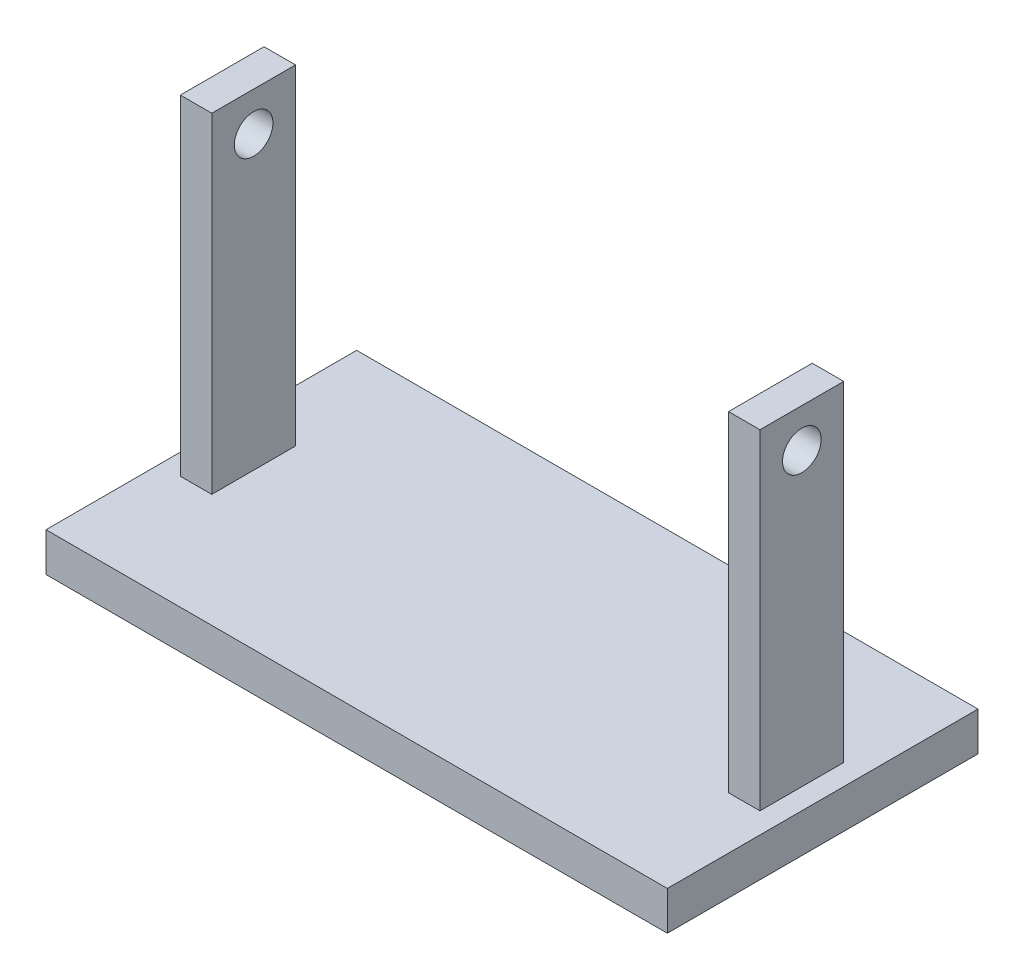
ISO-10303-21;
HEADER;
FILE_DESCRIPTION(('STEP AP214'),'2;1');
FILE_NAME('part.step','',(''),(''),'','','');
FILE_SCHEMA(('AUTOMOTIVE_DESIGN { 1 0 10303 214 1 1 1 1 }'));
ENDSEC;
DATA;
#1=APPLICATION_CONTEXT('core data for automotive mechanical design processes');
#2=APPLICATION_PROTOCOL_DEFINITION('international standard','automotive_design',2000,#1);
#3=PRODUCT_CONTEXT('',#1,'mechanical');
#4=PRODUCT('Part','Part','',(#3));
#5=PRODUCT_RELATED_PRODUCT_CATEGORY('part','',(#4));
#6=PRODUCT_DEFINITION_FORMATION('','',#4);
#7=PRODUCT_DEFINITION_CONTEXT('part definition',#1,'design');
#8=PRODUCT_DEFINITION('design','',#6,#7);
#9=PRODUCT_DEFINITION_SHAPE('','',#8);
#10=(LENGTH_UNIT() NAMED_UNIT(*) SI_UNIT(.MILLI.,.METRE.));
#11=(NAMED_UNIT(*) PLANE_ANGLE_UNIT() SI_UNIT($,.RADIAN.));
#12=(NAMED_UNIT(*) SI_UNIT($,.STERADIAN.) SOLID_ANGLE_UNIT());
#13=UNCERTAINTY_MEASURE_WITH_UNIT(LENGTH_MEASURE(1.E-05),#10,'distance_accuracy_value','');
#14=(GEOMETRIC_REPRESENTATION_CONTEXT(3) GLOBAL_UNCERTAINTY_ASSIGNED_CONTEXT((#13)) GLOBAL_UNIT_ASSIGNED_CONTEXT((#10,
#11,#12)) REPRESENTATION_CONTEXT('',''));
#15=CARTESIAN_POINT('',(0.,0.,0.));
#16=DIRECTION('',(0.,0.,1.));
#17=DIRECTION('',(1.,0.,0.));
#18=AXIS2_PLACEMENT_3D('',#15,#16,#17);
#19=CARTESIAN_POINT('',(74.6314159810439,95.,-10.7820456424634));
#20=DIRECTION('',(1.,0.,0.));
#21=DIRECTION('',(0.,0.,-1.));
#22=AXIS2_PLACEMENT_3D('',#19,#20,#21);
#23=PLANE('',#22);
#24=CARTESIAN_POINT('',(74.6314159810439,85.,0.));
#25=DIRECTION('',(1.,0.,0.));
#26=DIRECTION('',(0.,0.,-1.));
#27=AXIS2_PLACEMENT_3D('',#24,#25,#26);
#28=CIRCLE('',#27,4.97317490050383);
#29=CARTESIAN_POINT('',(74.6314159810439,85.,-4.97317490050384));
#30=VERTEX_POINT('',#29);
#31=EDGE_CURVE('E293',#30,#30,#28,.T.);
#32=ORIENTED_EDGE('',*,*,#31,.F.);
#33=EDGE_LOOP('',(#32));
#34=FACE_BOUND('',#33,.T.);
#35=DIRECTION('',(0.,-1.,0.));
#36=VECTOR('',#35,1.);
#37=CARTESIAN_POINT('',(74.6314159810439,95.,10.7820456424634));
#38=LINE('',#37,#36);
#39=CARTESIAN_POINT('',(74.6314159810439,95.,10.7820456424634));
#40=VERTEX_POINT('',#39);
#41=CARTESIAN_POINT('',(74.6314159810439,9.99999999999999,10.7820456424634));
#42=VERTEX_POINT('',#41);
#43=EDGE_CURVE('E208',#40,#42,#38,.T.);
#44=ORIENTED_EDGE('',*,*,#43,.T.);
#45=DIRECTION('',(0.,0.,-1.));
#46=VECTOR('',#45,1.);
#47=CARTESIAN_POINT('',(74.6314159810439,10.,-10.7820456424634));
#48=LINE('',#47,#46);
#49=CARTESIAN_POINT('',(74.6314159810439,10.,-10.7820456424634));
#50=VERTEX_POINT('',#49);
#51=EDGE_CURVE('E49',#42,#50,#48,.T.);
#52=ORIENTED_EDGE('',*,*,#51,.T.);
#53=DIRECTION('',(0.,-1.,0.));
#54=VECTOR('',#53,1.);
#55=CARTESIAN_POINT('',(74.6314159810439,95.,-10.7820456424634));
#56=LINE('',#55,#54);
#57=CARTESIAN_POINT('',(74.6314159810439,95.,-10.7820456424634));
#58=VERTEX_POINT('',#57);
#59=EDGE_CURVE('E11',#58,#50,#56,.T.);
#60=ORIENTED_EDGE('',*,*,#59,.F.);
#61=DIRECTION('',(0.,0.,1.));
#62=VECTOR('',#61,1.);
#63=CARTESIAN_POINT('',(74.6314159810439,95.,-10.7820456424634));
#64=LINE('',#63,#62);
#65=EDGE_CURVE('E200',#58,#40,#64,.T.);
#66=ORIENTED_EDGE('',*,*,#65,.T.);
#67=EDGE_LOOP('',(#44,#52,#60,#66));
#68=FACE_BOUND('',#67,.T.);
#69=ADVANCED_FACE('F33',(#34,#68),#23,.T.);
#70=CARTESIAN_POINT('',(74.6314159810439,95.,-10.7820456424634));
#71=DIRECTION('',(0.,0.,1.));
#72=DIRECTION('',(1.,0.,0.));
#73=AXIS2_PLACEMENT_3D('',#70,#71,#72);
#74=PLANE('',#73);
#75=DIRECTION('',(-1.,0.,0.));
#76=VECTOR('',#75,1.);
#77=CARTESIAN_POINT('',(74.6314159810439,10.,-10.7820456424634));
#78=LINE('',#77,#76);
#79=CARTESIAN_POINT('',(66.5327026150507,10.,-10.7820456424634));
#80=VERTEX_POINT('',#79);
#81=EDGE_CURVE('E162',#50,#80,#78,.T.);
#82=ORIENTED_EDGE('',*,*,#81,.T.);
#83=DIRECTION('',(0.,-1.,0.));
#84=VECTOR('',#83,1.);
#85=CARTESIAN_POINT('',(66.5327026150507,95.,-10.7820456424634));
#86=LINE('',#85,#84);
#87=CARTESIAN_POINT('',(66.5327026150507,95.,-10.7820456424634));
#88=VERTEX_POINT('',#87);
#89=EDGE_CURVE('E41',#88,#80,#86,.T.);
#90=ORIENTED_EDGE('',*,*,#89,.F.);
#91=DIRECTION('',(-1.,0.,0.));
#92=VECTOR('',#91,1.);
#93=CARTESIAN_POINT('',(74.6314159810439,95.,-10.7820456424634));
#94=LINE('',#93,#92);
#95=EDGE_CURVE('E207',#58,#88,#94,.T.);
#96=ORIENTED_EDGE('',*,*,#95,.F.);
#97=ORIENTED_EDGE('',*,*,#59,.T.);
#98=EDGE_LOOP('',(#82,#90,#96,#97));
#99=FACE_BOUND('',#98,.T.);
#100=ADVANCED_FACE('F229',(#99),#74,.F.);
#101=CARTESIAN_POINT('',(66.5327026150507,95.,-10.7820456424634));
#102=DIRECTION('',(1.,0.,0.));
#103=DIRECTION('',(0.,0.,-1.));
#104=AXIS2_PLACEMENT_3D('',#101,#102,#103);
#105=PLANE('',#104);
#106=CARTESIAN_POINT('',(66.5327026150507,85.,0.));
#107=DIRECTION('',(1.,0.,0.));
#108=DIRECTION('',(0.,0.,-1.));
#109=AXIS2_PLACEMENT_3D('',#106,#107,#108);
#110=CIRCLE('',#109,4.97317490050383);
#111=CARTESIAN_POINT('',(66.5327026150507,85.,-4.97317490050384));
#112=VERTEX_POINT('',#111);
#113=EDGE_CURVE('E296',#112,#112,#110,.T.);
#114=ORIENTED_EDGE('',*,*,#113,.T.);
#115=EDGE_LOOP('',(#114));
#116=FACE_BOUND('',#115,.T.);
#117=DIRECTION('',(0.,0.,1.));
#118=VECTOR('',#117,1.);
#119=CARTESIAN_POINT('',(66.5327026150507,10.,-10.7820456424634));
#120=LINE('',#119,#118);
#121=CARTESIAN_POINT('',(66.5327026150507,10.,10.7820456424634));
#122=VERTEX_POINT('',#121);
#123=EDGE_CURVE('E165',#80,#122,#120,.T.);
#124=ORIENTED_EDGE('',*,*,#123,.T.);
#125=DIRECTION('',(0.,-1.,0.));
#126=VECTOR('',#125,1.);
#127=CARTESIAN_POINT('',(66.5327026150507,95.,10.7820456424634));
#128=LINE('',#127,#126);
#129=CARTESIAN_POINT('',(66.5327026150507,95.,10.7820456424634));
#130=VERTEX_POINT('',#129);
#131=EDGE_CURVE('E212',#130,#122,#128,.T.);
#132=ORIENTED_EDGE('',*,*,#131,.F.);
#133=DIRECTION('',(0.,0.,1.));
#134=VECTOR('',#133,1.);
#135=CARTESIAN_POINT('',(66.5327026150507,95.,-10.7820456424634));
#136=LINE('',#135,#134);
#137=EDGE_CURVE('E205',#88,#130,#136,.T.);
#138=ORIENTED_EDGE('',*,*,#137,.F.);
#139=ORIENTED_EDGE('',*,*,#89,.T.);
#140=EDGE_LOOP('',(#124,#132,#138,#139));
#141=FACE_BOUND('',#140,.T.);
#142=ADVANCED_FACE('F225',(#116,#141),#105,.F.);
#143=CARTESIAN_POINT('',(74.6314159810439,95.,10.7820456424634));
#144=DIRECTION('',(0.,0.,1.));
#145=DIRECTION('',(1.,0.,0.));
#146=AXIS2_PLACEMENT_3D('',#143,#144,#145);
#147=PLANE('',#146);
#148=ORIENTED_EDGE('',*,*,#131,.T.);
#149=DIRECTION('',(1.,0.,0.));
#150=VECTOR('',#149,1.);
#151=CARTESIAN_POINT('',(74.6314159810439,10.,10.7820456424634));
#152=LINE('',#151,#150);
#153=EDGE_CURVE('E168',#122,#42,#152,.T.);
#154=ORIENTED_EDGE('',*,*,#153,.T.);
#155=ORIENTED_EDGE('',*,*,#43,.F.);
#156=DIRECTION('',(-1.,0.,0.));
#157=VECTOR('',#156,1.);
#158=CARTESIAN_POINT('',(74.6314159810439,95.,10.7820456424634));
#159=LINE('',#158,#157);
#160=EDGE_CURVE('E202',#40,#130,#159,.T.);
#161=ORIENTED_EDGE('',*,*,#160,.T.);
#162=EDGE_LOOP('',(#148,#154,#155,#161));
#163=FACE_BOUND('',#162,.T.);
#164=ADVANCED_FACE('F218',(#163),#147,.T.);
#165=CARTESIAN_POINT('',(0.,95.,0.));
#166=DIRECTION('',(0.,-1.,0.));
#167=DIRECTION('',(0.,0.,-1.));
#168=AXIS2_PLACEMENT_3D('',#165,#166,#167);
#169=PLANE('',#168);
#170=ORIENTED_EDGE('',*,*,#65,.F.);
#171=ORIENTED_EDGE('',*,*,#95,.T.);
#172=ORIENTED_EDGE('',*,*,#137,.T.);
#173=ORIENTED_EDGE('',*,*,#160,.F.);
#174=EDGE_LOOP('',(#170,#171,#172,#173));
#175=FACE_BOUND('',#174,.T.);
#176=ADVANCED_FACE('F220',(#175),#169,.F.);
#177=CARTESIAN_POINT('',(0.,10.,0.));
#178=DIRECTION('',(0.,-1.,0.));
#179=DIRECTION('',(0.,0.,-1.));
#180=AXIS2_PLACEMENT_3D('',#177,#178,#179);
#181=PLANE('',#180);
#182=ORIENTED_EDGE('',*,*,#51,.F.);
#183=ORIENTED_EDGE('',*,*,#153,.F.);
#184=ORIENTED_EDGE('',*,*,#123,.F.);
#185=ORIENTED_EDGE('',*,*,#81,.F.);
#186=EDGE_LOOP('',(#182,#183,#184,#185));
#187=FACE_BOUND('',#186,.T.);
#188=DIRECTION('',(-1.,0.,0.));
#189=VECTOR('',#188,1.);
#190=CARTESIAN_POINT('',(-80.,10.,-40.));
#191=LINE('',#190,#189);
#192=CARTESIAN_POINT('',(80.,10.,-40.));
#193=VERTEX_POINT('',#192);
#194=CARTESIAN_POINT('',(-80.,10.,-40.));
#195=VERTEX_POINT('',#194);
#196=EDGE_CURVE('E171',#193,#195,#191,.T.);
#197=ORIENTED_EDGE('',*,*,#196,.T.);
#198=DIRECTION('',(0.,0.,1.));
#199=VECTOR('',#198,1.);
#200=CARTESIAN_POINT('',(-80.,10.,-40.));
#201=LINE('',#200,#199);
#202=CARTESIAN_POINT('',(-80.,10.,40.));
#203=VERTEX_POINT('',#202);
#204=EDGE_CURVE('E174',#195,#203,#201,.T.);
#205=ORIENTED_EDGE('',*,*,#204,.T.);
#206=DIRECTION('',(1.,0.,0.));
#207=VECTOR('',#206,1.);
#208=CARTESIAN_POINT('',(-80.,10.,40.));
#209=LINE('',#208,#207);
#210=CARTESIAN_POINT('',(80.,10.,40.));
#211=VERTEX_POINT('',#210);
#212=EDGE_CURVE('E177',#203,#211,#209,.T.);
#213=ORIENTED_EDGE('',*,*,#212,.T.);
#214=DIRECTION('',(0.,0.,-1.));
#215=VECTOR('',#214,1.);
#216=CARTESIAN_POINT('',(80.,10.,-40.));
#217=LINE('',#216,#215);
#218=EDGE_CURVE('E179',#211,#193,#217,.T.);
#219=ORIENTED_EDGE('',*,*,#218,.T.);
#220=EDGE_LOOP('',(#197,#205,#213,#219));
#221=FACE_BOUND('',#220,.T.);
#222=DIRECTION('',(-1.,0.,0.));
#223=VECTOR('',#222,1.);
#224=CARTESIAN_POINT('',(-74.6314159810439,10.,-10.7820456424634));
#225=LINE('',#224,#223);
#226=CARTESIAN_POINT('',(-66.5327026150507,10.,-10.7820456424634));
#227=VERTEX_POINT('',#226);
#228=CARTESIAN_POINT('',(-74.6314159810439,9.99999999999999,-10.7820456424634));
#229=VERTEX_POINT('',#228);
#230=EDGE_CURVE('E129',#227,#229,#225,.T.);
#231=ORIENTED_EDGE('',*,*,#230,.F.);
#232=DIRECTION('',(0.,0.,-1.));
#233=VECTOR('',#232,1.);
#234=CARTESIAN_POINT('',(-66.5327026150507,10.,-10.7820456424634));
#235=LINE('',#234,#233);
#236=CARTESIAN_POINT('',(-66.5327026150507,10.,10.7820456424634));
#237=VERTEX_POINT('',#236);
#238=EDGE_CURVE('E158',#237,#227,#235,.T.);
#239=ORIENTED_EDGE('',*,*,#238,.F.);
#240=DIRECTION('',(1.,0.,0.));
#241=VECTOR('',#240,1.);
#242=CARTESIAN_POINT('',(-74.6314159810439,10.,10.7820456424634));
#243=LINE('',#242,#241);
#244=CARTESIAN_POINT('',(-74.6314159810439,10.,10.7820456424634));
#245=VERTEX_POINT('',#244);
#246=EDGE_CURVE('E155',#245,#237,#243,.T.);
#247=ORIENTED_EDGE('',*,*,#246,.F.);
#248=DIRECTION('',(0.,0.,1.));
#249=VECTOR('',#248,1.);
#250=CARTESIAN_POINT('',(-74.6314159810439,10.,-10.7820456424634));
#251=LINE('',#250,#249);
#252=EDGE_CURVE('E153',#229,#245,#251,.T.);
#253=ORIENTED_EDGE('',*,*,#252,.F.);
#254=EDGE_LOOP('',(#231,#239,#247,#253));
#255=FACE_BOUND('',#254,.T.);
#256=ADVANCED_FACE('F226',(#187,#221,#255),#181,.F.);
#257=CARTESIAN_POINT('',(-80.,10.,-40.));
#258=DIRECTION('',(0.,0.,1.));
#259=DIRECTION('',(1.,0.,0.));
#260=AXIS2_PLACEMENT_3D('',#257,#258,#259);
#261=PLANE('',#260);
#262=DIRECTION('',(-1.,0.,0.));
#263=VECTOR('',#262,1.);
#264=CARTESIAN_POINT('',(-80.,0.,-40.));
#265=LINE('',#264,#263);
#266=CARTESIAN_POINT('',(80.,0.,-40.));
#267=VERTEX_POINT('',#266);
#268=CARTESIAN_POINT('',(-80.,0.,-40.));
#269=VERTEX_POINT('',#268);
#270=EDGE_CURVE('E170',#267,#269,#265,.T.);
#271=ORIENTED_EDGE('',*,*,#270,.T.);
#272=DIRECTION('',(0.,-1.,0.));
#273=VECTOR('',#272,1.);
#274=CARTESIAN_POINT('',(-80.,10.,-40.));
#275=LINE('',#274,#273);
#276=EDGE_CURVE('E197',#195,#269,#275,.T.);
#277=ORIENTED_EDGE('',*,*,#276,.F.);
#278=ORIENTED_EDGE('',*,*,#196,.F.);
#279=DIRECTION('',(0.,-1.,0.));
#280=VECTOR('',#279,1.);
#281=CARTESIAN_POINT('',(80.,10.,-40.));
#282=LINE('',#281,#280);
#283=EDGE_CURVE('E181',#193,#267,#282,.T.);
#284=ORIENTED_EDGE('',*,*,#283,.T.);
#285=EDGE_LOOP('',(#271,#277,#278,#284));
#286=FACE_BOUND('',#285,.T.);
#287=ADVANCED_FACE('F249',(#286),#261,.F.);
#288=CARTESIAN_POINT('',(-80.,10.,-40.));
#289=DIRECTION('',(1.,0.,0.));
#290=DIRECTION('',(0.,0.,-1.));
#291=AXIS2_PLACEMENT_3D('',#288,#289,#290);
#292=PLANE('',#291);
#293=DIRECTION('',(0.,0.,1.));
#294=VECTOR('',#293,1.);
#295=CARTESIAN_POINT('',(-80.,0.,-40.));
#296=LINE('',#295,#294);
#297=CARTESIAN_POINT('',(-80.,0.,40.));
#298=VERTEX_POINT('',#297);
#299=EDGE_CURVE('E184',#269,#298,#296,.T.);
#300=ORIENTED_EDGE('',*,*,#299,.T.);
#301=DIRECTION('',(0.,-1.,0.));
#302=VECTOR('',#301,1.);
#303=CARTESIAN_POINT('',(-80.,10.,40.));
#304=LINE('',#303,#302);
#305=EDGE_CURVE('E194',#203,#298,#304,.T.);
#306=ORIENTED_EDGE('',*,*,#305,.F.);
#307=ORIENTED_EDGE('',*,*,#204,.F.);
#308=ORIENTED_EDGE('',*,*,#276,.T.);
#309=EDGE_LOOP('',(#300,#306,#307,#308));
#310=FACE_BOUND('',#309,.T.);
#311=ADVANCED_FACE('F254',(#310),#292,.F.);
#312=CARTESIAN_POINT('',(-80.,10.,40.));
#313=DIRECTION('',(0.,0.,-1.));
#314=DIRECTION('',(-1.,0.,0.));
#315=AXIS2_PLACEMENT_3D('',#312,#313,#314);
#316=PLANE('',#315);
#317=DIRECTION('',(1.,0.,0.));
#318=VECTOR('',#317,1.);
#319=CARTESIAN_POINT('',(-80.,0.,40.));
#320=LINE('',#319,#318);
#321=CARTESIAN_POINT('',(80.,0.,40.));
#322=VERTEX_POINT('',#321);
#323=EDGE_CURVE('E186',#298,#322,#320,.T.);
#324=ORIENTED_EDGE('',*,*,#323,.T.);
#325=DIRECTION('',(0.,-1.,0.));
#326=VECTOR('',#325,1.);
#327=CARTESIAN_POINT('',(80.,10.,40.));
#328=LINE('',#327,#326);
#329=EDGE_CURVE('E191',#211,#322,#328,.T.);
#330=ORIENTED_EDGE('',*,*,#329,.F.);
#331=ORIENTED_EDGE('',*,*,#212,.F.);
#332=ORIENTED_EDGE('',*,*,#305,.T.);
#333=EDGE_LOOP('',(#324,#330,#331,#332));
#334=FACE_BOUND('',#333,.T.);
#335=ADVANCED_FACE('F258',(#334),#316,.F.);
#336=CARTESIAN_POINT('',(80.,10.,-40.));
#337=DIRECTION('',(-1.,0.,0.));
#338=DIRECTION('',(0.,0.,1.));
#339=AXIS2_PLACEMENT_3D('',#336,#337,#338);
#340=PLANE('',#339);
#341=DIRECTION('',(0.,0.,-1.));
#342=VECTOR('',#341,1.);
#343=CARTESIAN_POINT('',(80.,0.,-40.));
#344=LINE('',#343,#342);
#345=EDGE_CURVE('E175',#322,#267,#344,.T.);
#346=ORIENTED_EDGE('',*,*,#345,.T.);
#347=ORIENTED_EDGE('',*,*,#283,.F.);
#348=ORIENTED_EDGE('',*,*,#218,.F.);
#349=ORIENTED_EDGE('',*,*,#329,.T.);
#350=EDGE_LOOP('',(#346,#347,#348,#349));
#351=FACE_BOUND('',#350,.T.);
#352=ADVANCED_FACE('F262',(#351),#340,.F.);
#353=CARTESIAN_POINT('',(0.,0.,0.));
#354=DIRECTION('',(0.,-1.,0.));
#355=DIRECTION('',(0.,0.,-1.));
#356=AXIS2_PLACEMENT_3D('',#353,#354,#355);
#357=PLANE('',#356);
#358=ORIENTED_EDGE('',*,*,#270,.F.);
#359=ORIENTED_EDGE('',*,*,#345,.F.);
#360=ORIENTED_EDGE('',*,*,#323,.F.);
#361=ORIENTED_EDGE('',*,*,#299,.F.);
#362=EDGE_LOOP('',(#358,#359,#360,#361));
#363=FACE_BOUND('',#362,.T.);
#364=ADVANCED_FACE('F240',(#363),#357,.T.);
#365=CARTESIAN_POINT('',(-74.6314159810439,95.,-10.7820456424634));
#366=DIRECTION('',(1.,0.,0.));
#367=DIRECTION('',(0.,0.,-1.));
#368=AXIS2_PLACEMENT_3D('',#365,#366,#367);
#369=PLANE('',#368);
#370=CARTESIAN_POINT('',(-74.6314159810439,85.,0.));
#371=DIRECTION('',(1.,0.,0.));
#372=DIRECTION('',(0.,0.,-1.));
#373=AXIS2_PLACEMENT_3D('',#370,#371,#372);
#374=CIRCLE('',#373,4.97317490050383);
#375=CARTESIAN_POINT('',(-74.6314159810439,85.,-4.97317490050384));
#376=VERTEX_POINT('',#375);
#377=EDGE_CURVE('E297',#376,#376,#374,.T.);
#378=ORIENTED_EDGE('',*,*,#377,.T.);
#379=EDGE_LOOP('',(#378));
#380=FACE_BOUND('',#379,.T.);
#381=DIRECTION('',(0.,-1.,0.));
#382=VECTOR('',#381,1.);
#383=CARTESIAN_POINT('',(-74.6314159810439,95.,-10.7820456424634));
#384=LINE('',#383,#382);
#385=CARTESIAN_POINT('',(-74.6314159810439,95.,-10.7820456424634));
#386=VERTEX_POINT('',#385);
#387=EDGE_CURVE('E123',#386,#229,#384,.T.);
#388=ORIENTED_EDGE('',*,*,#387,.T.);
#389=ORIENTED_EDGE('',*,*,#252,.T.);
#390=DIRECTION('',(0.,-1.,0.));
#391=VECTOR('',#390,1.);
#392=CARTESIAN_POINT('',(-74.6314159810439,95.,10.7820456424634));
#393=LINE('',#392,#391);
#394=CARTESIAN_POINT('',(-74.6314159810439,95.,10.7820456424634));
#395=VERTEX_POINT('',#394);
#396=EDGE_CURVE('E139',#395,#245,#393,.T.);
#397=ORIENTED_EDGE('',*,*,#396,.F.);
#398=DIRECTION('',(0.,0.,1.));
#399=VECTOR('',#398,1.);
#400=CARTESIAN_POINT('',(-74.6314159810439,95.,-10.7820456424634));
#401=LINE('',#400,#399);
#402=EDGE_CURVE('E136',#386,#395,#401,.T.);
#403=ORIENTED_EDGE('',*,*,#402,.F.);
#404=EDGE_LOOP('',(#388,#389,#397,#403));
#405=FACE_BOUND('',#404,.T.);
#406=ADVANCED_FACE('F137',(#380,#405),#369,.F.);
#407=CARTESIAN_POINT('',(-74.6314159810439,95.,10.7820456424634));
#408=DIRECTION('',(0.,0.,-1.));
#409=DIRECTION('',(-1.,0.,0.));
#410=AXIS2_PLACEMENT_3D('',#407,#408,#409);
#411=PLANE('',#410);
#412=ORIENTED_EDGE('',*,*,#396,.T.);
#413=ORIENTED_EDGE('',*,*,#246,.T.);
#414=DIRECTION('',(0.,-1.,0.));
#415=VECTOR('',#414,1.);
#416=CARTESIAN_POINT('',(-66.5327026150507,95.,10.7820456424634));
#417=LINE('',#416,#415);
#418=CARTESIAN_POINT('',(-66.5327026150507,95.,10.7820456424634));
#419=VERTEX_POINT('',#418);
#420=EDGE_CURVE('E299',#419,#237,#417,.T.);
#421=ORIENTED_EDGE('',*,*,#420,.F.);
#422=DIRECTION('',(1.,0.,0.));
#423=VECTOR('',#422,1.);
#424=CARTESIAN_POINT('',(-74.6314159810439,95.,10.7820456424634));
#425=LINE('',#424,#423);
#426=EDGE_CURVE('E141',#395,#419,#425,.T.);
#427=ORIENTED_EDGE('',*,*,#426,.F.);
#428=EDGE_LOOP('',(#412,#413,#421,#427));
#429=FACE_BOUND('',#428,.T.);
#430=ADVANCED_FACE('F275',(#429),#411,.F.);
#431=CARTESIAN_POINT('',(-66.5327026150507,95.,-10.7820456424634));
#432=DIRECTION('',(1.,0.,0.));
#433=DIRECTION('',(0.,0.,-1.));
#434=AXIS2_PLACEMENT_3D('',#431,#432,#433);
#435=PLANE('',#434);
#436=CARTESIAN_POINT('',(-66.5327026150507,85.,0.));
#437=DIRECTION('',(1.,0.,0.));
#438=DIRECTION('',(0.,0.,-1.));
#439=AXIS2_PLACEMENT_3D('',#436,#437,#438);
#440=CIRCLE('',#439,4.97317490050383);
#441=CARTESIAN_POINT('',(-66.5327026150507,85.,-4.97317490050384));
#442=VERTEX_POINT('',#441);
#443=EDGE_CURVE('E36',#442,#442,#440,.T.);
#444=ORIENTED_EDGE('',*,*,#443,.F.);
#445=EDGE_LOOP('',(#444));
#446=FACE_BOUND('',#445,.T.);
#447=ORIENTED_EDGE('',*,*,#238,.T.);
#448=DIRECTION('',(0.,-1.,0.));
#449=VECTOR('',#448,1.);
#450=CARTESIAN_POINT('',(-66.5327026150507,95.,-10.7820456424634));
#451=LINE('',#450,#449);
#452=CARTESIAN_POINT('',(-66.5327026150507,95.,-10.7820456424634));
#453=VERTEX_POINT('',#452);
#454=EDGE_CURVE('E132',#453,#227,#451,.T.);
#455=ORIENTED_EDGE('',*,*,#454,.F.);
#456=DIRECTION('',(0.,0.,1.));
#457=VECTOR('',#456,1.);
#458=CARTESIAN_POINT('',(-66.5327026150507,95.,-10.7820456424634));
#459=LINE('',#458,#457);
#460=EDGE_CURVE('E146',#453,#419,#459,.T.);
#461=ORIENTED_EDGE('',*,*,#460,.T.);
#462=ORIENTED_EDGE('',*,*,#420,.T.);
#463=EDGE_LOOP('',(#447,#455,#461,#462));
#464=FACE_BOUND('',#463,.T.);
#465=ADVANCED_FACE('F272',(#446,#464),#435,.T.);
#466=CARTESIAN_POINT('',(-74.6314159810439,95.,-10.7820456424634));
#467=DIRECTION('',(0.,0.,-1.));
#468=DIRECTION('',(-1.,0.,0.));
#469=AXIS2_PLACEMENT_3D('',#466,#467,#468);
#470=PLANE('',#469);
#471=ORIENTED_EDGE('',*,*,#230,.T.);
#472=ORIENTED_EDGE('',*,*,#387,.F.);
#473=DIRECTION('',(1.,0.,0.));
#474=VECTOR('',#473,1.);
#475=CARTESIAN_POINT('',(-74.6314159810439,95.,-10.7820456424634));
#476=LINE('',#475,#474);
#477=EDGE_CURVE('E128',#386,#453,#476,.T.);
#478=ORIENTED_EDGE('',*,*,#477,.T.);
#479=ORIENTED_EDGE('',*,*,#454,.T.);
#480=EDGE_LOOP('',(#471,#472,#478,#479));
#481=FACE_BOUND('',#480,.T.);
#482=ADVANCED_FACE('F125',(#481),#470,.T.);
#483=CARTESIAN_POINT('',(0.,95.,0.));
#484=DIRECTION('',(0.,1.,0.));
#485=DIRECTION('',(0.,0.,1.));
#486=AXIS2_PLACEMENT_3D('',#483,#484,#485);
#487=PLANE('',#486);
#488=ORIENTED_EDGE('',*,*,#402,.T.);
#489=ORIENTED_EDGE('',*,*,#426,.T.);
#490=ORIENTED_EDGE('',*,*,#460,.F.);
#491=ORIENTED_EDGE('',*,*,#477,.F.);
#492=EDGE_LOOP('',(#488,#489,#490,#491));
#493=FACE_BOUND('',#492,.T.);
#494=ADVANCED_FACE('F144',(#493),#487,.T.);
#495=CARTESIAN_POINT('',(-80.,85.,0.));
#496=DIRECTION('',(1.,0.,0.));
#497=DIRECTION('',(0.,0.,-1.));
#498=AXIS2_PLACEMENT_3D('',#495,#496,#497);
#499=CYLINDRICAL_SURFACE('',#498,4.97317490050383);
#500=ORIENTED_EDGE('',*,*,#443,.T.);
#501=EDGE_LOOP('',(#500));
#502=FACE_BOUND('',#501,.T.);
#503=ORIENTED_EDGE('',*,*,#377,.F.);
#504=EDGE_LOOP('',(#503));
#505=FACE_BOUND('',#504,.T.);
#506=ADVANCED_FACE('F269',(#502,#505),#499,.F.);
#507=ORIENTED_EDGE('',*,*,#31,.T.);
#508=EDGE_LOOP('',(#507));
#509=FACE_BOUND('',#508,.T.);
#510=ORIENTED_EDGE('',*,*,#113,.F.);
#511=EDGE_LOOP('',(#510));
#512=FACE_BOUND('',#511,.T.);
#513=ADVANCED_FACE('F283',(#509,#512),#499,.F.);
#514=CLOSED_SHELL('',(#69,#100,#142,#164,#176,#256,#287,#311,#335,#352,#364,#406,#430,#465,#482,
#494,#506,#513));
#515=MANIFOLD_SOLID_BREP('B2',#514);
#516=ADVANCED_BREP_SHAPE_REPRESENTATION('',(#18,#515),#14);
#517=SHAPE_DEFINITION_REPRESENTATION(#9,#516);
ENDSEC;
END-ISO-10303-21;
